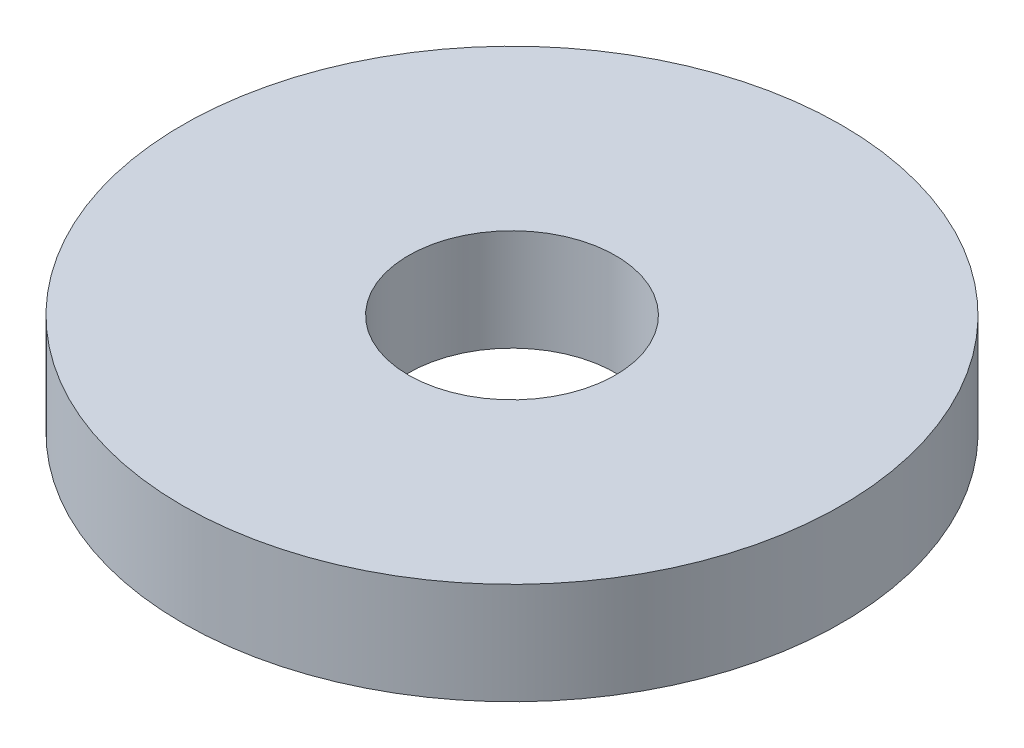
ISO-10303-21;
HEADER;
FILE_DESCRIPTION(('STEP AP214'),'2;1');
FILE_NAME('part.step','',(''),(''),'','','');
FILE_SCHEMA(('AUTOMOTIVE_DESIGN { 1 0 10303 214 1 1 1 1 }'));
ENDSEC;
DATA;
#1=APPLICATION_CONTEXT('core data for automotive mechanical design processes');
#2=APPLICATION_PROTOCOL_DEFINITION('international standard','automotive_design',2000,#1);
#3=PRODUCT_CONTEXT('',#1,'mechanical');
#4=PRODUCT('Part','Part','',(#3));
#5=PRODUCT_RELATED_PRODUCT_CATEGORY('part','',(#4));
#6=PRODUCT_DEFINITION_FORMATION('','',#4);
#7=PRODUCT_DEFINITION_CONTEXT('part definition',#1,'design');
#8=PRODUCT_DEFINITION('design','',#6,#7);
#9=PRODUCT_DEFINITION_SHAPE('','',#8);
#10=(LENGTH_UNIT() NAMED_UNIT(*) SI_UNIT(.MILLI.,.METRE.));
#11=(NAMED_UNIT(*) PLANE_ANGLE_UNIT() SI_UNIT($,.RADIAN.));
#12=(NAMED_UNIT(*) SI_UNIT($,.STERADIAN.) SOLID_ANGLE_UNIT());
#13=UNCERTAINTY_MEASURE_WITH_UNIT(LENGTH_MEASURE(1.E-05),#10,'distance_accuracy_value','');
#14=(GEOMETRIC_REPRESENTATION_CONTEXT(3) GLOBAL_UNCERTAINTY_ASSIGNED_CONTEXT((#13)) GLOBAL_UNIT_ASSIGNED_CONTEXT((#10,
#11,#12)) REPRESENTATION_CONTEXT('',''));
#15=CARTESIAN_POINT('',(0.,0.,0.));
#16=DIRECTION('',(0.,0.,1.));
#17=DIRECTION('',(1.,0.,0.));
#18=AXIS2_PLACEMENT_3D('',#15,#16,#17);
#19=CARTESIAN_POINT('',(0.,27.,0.));
#20=DIRECTION('',(0.,-1.,0.));
#21=DIRECTION('',(0.,0.,-1.));
#22=AXIS2_PLACEMENT_3D('',#19,#20,#21);
#23=CYLINDRICAL_SURFACE('',#22,87.5);
#24=CARTESIAN_POINT('',(0.,27.,0.));
#25=DIRECTION('',(0.,1.,0.));
#26=DIRECTION('',(0.,0.,1.));
#27=AXIS2_PLACEMENT_3D('',#24,#25,#26);
#28=CIRCLE('',#27,87.5);
#29=CARTESIAN_POINT('',(0.,27.,87.5));
#30=VERTEX_POINT('',#29);
#31=EDGE_CURVE('E10',#30,#30,#28,.T.);
#32=ORIENTED_EDGE('',*,*,#31,.F.);
#33=EDGE_LOOP('',(#32));
#34=FACE_BOUND('',#33,.T.);
#35=CARTESIAN_POINT('',(0.,0.,0.));
#36=DIRECTION('',(0.,1.,0.));
#37=DIRECTION('',(0.,0.,1.));
#38=AXIS2_PLACEMENT_3D('',#35,#36,#37);
#39=CIRCLE('',#38,87.5);
#40=CARTESIAN_POINT('',(0.,0.,87.5));
#41=VERTEX_POINT('',#40);
#42=EDGE_CURVE('E37',#41,#41,#39,.T.);
#43=ORIENTED_EDGE('',*,*,#42,.T.);
#44=EDGE_LOOP('',(#43));
#45=FACE_BOUND('',#44,.T.);
#46=ADVANCED_FACE('F40',(#34,#45),#23,.T.);
#47=CARTESIAN_POINT('',(0.,27.,0.));
#48=DIRECTION('',(0.,1.,0.));
#49=DIRECTION('',(0.,0.,1.));
#50=AXIS2_PLACEMENT_3D('',#47,#48,#49);
#51=PLANE('',#50);
#52=CARTESIAN_POINT('',(0.,27.,0.));
#53=DIRECTION('',(0.,1.,0.));
#54=DIRECTION('',(0.,0.,1.));
#55=AXIS2_PLACEMENT_3D('',#52,#53,#54);
#56=CIRCLE('',#55,27.5);
#57=CARTESIAN_POINT('',(0.,27.,27.5));
#58=VERTEX_POINT('',#57);
#59=EDGE_CURVE('E50',#58,#58,#56,.T.);
#60=ORIENTED_EDGE('',*,*,#59,.F.);
#61=EDGE_LOOP('',(#60));
#62=FACE_BOUND('',#61,.T.);
#63=ORIENTED_EDGE('',*,*,#31,.T.);
#64=EDGE_LOOP('',(#63));
#65=FACE_BOUND('',#64,.T.);
#66=ADVANCED_FACE('F59',(#62,#65),#51,.T.);
#67=CARTESIAN_POINT('',(0.,0.,0.));
#68=DIRECTION('',(0.,1.,0.));
#69=DIRECTION('',(0.,0.,1.));
#70=AXIS2_PLACEMENT_3D('',#67,#68,#69);
#71=PLANE('',#70);
#72=CARTESIAN_POINT('',(0.,0.,0.));
#73=DIRECTION('',(0.,1.,0.));
#74=DIRECTION('',(0.,0.,1.));
#75=AXIS2_PLACEMENT_3D('',#72,#73,#74);
#76=CIRCLE('',#75,27.5);
#77=CARTESIAN_POINT('',(0.,0.,27.5));
#78=VERTEX_POINT('',#77);
#79=EDGE_CURVE('E47',#78,#78,#76,.T.);
#80=ORIENTED_EDGE('',*,*,#79,.T.);
#81=EDGE_LOOP('',(#80));
#82=FACE_BOUND('',#81,.T.);
#83=ORIENTED_EDGE('',*,*,#42,.F.);
#84=EDGE_LOOP('',(#83));
#85=FACE_BOUND('',#84,.T.);
#86=ADVANCED_FACE('F58',(#82,#85),#71,.F.);
#87=CARTESIAN_POINT('',(0.,27.,0.));
#88=DIRECTION('',(0.,-1.,0.));
#89=DIRECTION('',(0.,0.,-1.));
#90=AXIS2_PLACEMENT_3D('',#87,#88,#89);
#91=CYLINDRICAL_SURFACE('',#90,27.5);
#92=ORIENTED_EDGE('',*,*,#59,.T.);
#93=EDGE_LOOP('',(#92));
#94=FACE_BOUND('',#93,.T.);
#95=ORIENTED_EDGE('',*,*,#79,.F.);
#96=EDGE_LOOP('',(#95));
#97=FACE_BOUND('',#96,.T.);
#98=ADVANCED_FACE('F54',(#94,#97),#91,.F.);
#99=CLOSED_SHELL('',(#46,#66,#86,#98));
#100=MANIFOLD_SOLID_BREP('B2',#99);
#101=ADVANCED_BREP_SHAPE_REPRESENTATION('',(#18,#100),#14);
#102=SHAPE_DEFINITION_REPRESENTATION(#9,#101);
ENDSEC;
END-ISO-10303-21;
